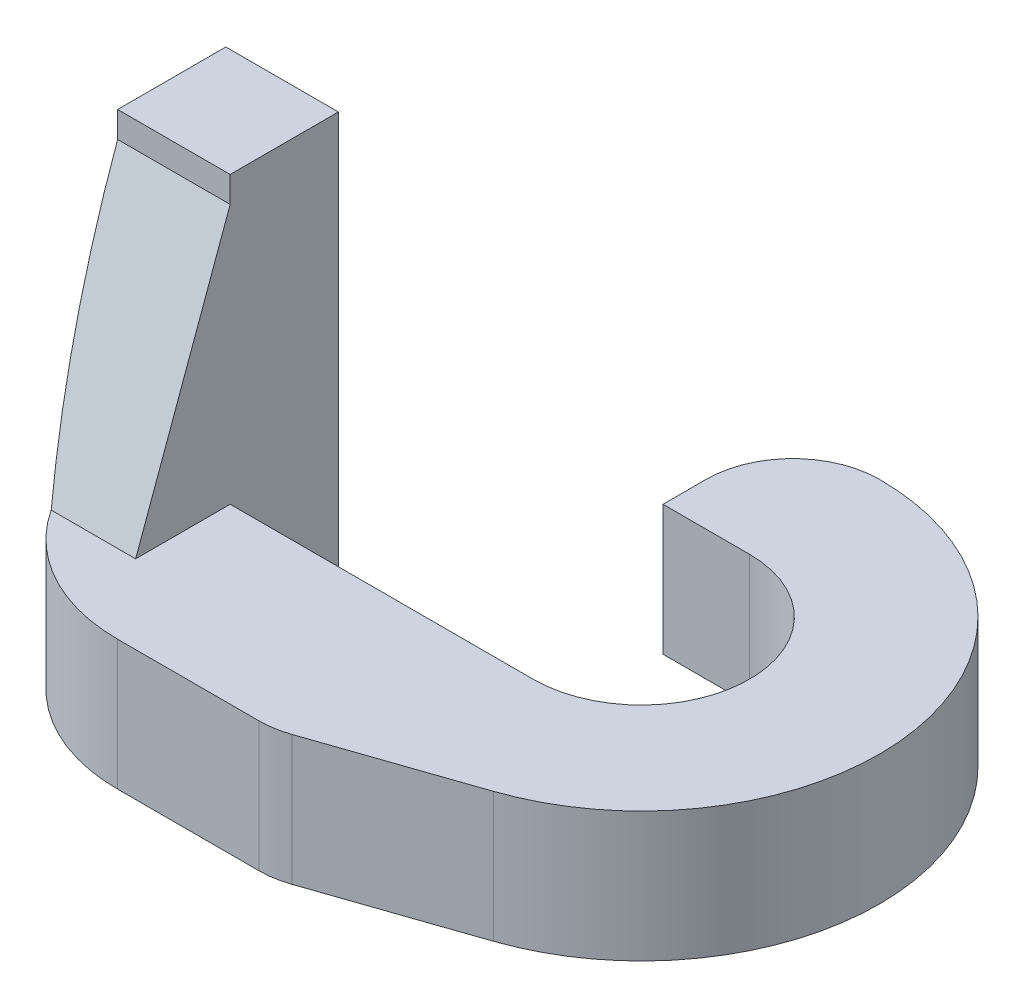
ISO-10303-21;
HEADER;
FILE_DESCRIPTION(('STEP AP214'),'2;1');
FILE_NAME('part.step','',(''),(''),'','','');
FILE_SCHEMA(('AUTOMOTIVE_DESIGN { 1 0 10303 214 1 1 1 1 }'));
ENDSEC;
DATA;
#1=APPLICATION_CONTEXT('core data for automotive mechanical design processes');
#2=APPLICATION_PROTOCOL_DEFINITION('international standard','automotive_design',2000,#1);
#3=PRODUCT_CONTEXT('',#1,'mechanical');
#4=PRODUCT('Part','Part','',(#3));
#5=PRODUCT_RELATED_PRODUCT_CATEGORY('part','',(#4));
#6=PRODUCT_DEFINITION_FORMATION('','',#4);
#7=PRODUCT_DEFINITION_CONTEXT('part definition',#1,'design');
#8=PRODUCT_DEFINITION('design','',#6,#7);
#9=PRODUCT_DEFINITION_SHAPE('','',#8);
#10=(LENGTH_UNIT() NAMED_UNIT(*) SI_UNIT(.MILLI.,.METRE.));
#11=(NAMED_UNIT(*) PLANE_ANGLE_UNIT() SI_UNIT($,.RADIAN.));
#12=(NAMED_UNIT(*) SI_UNIT($,.STERADIAN.) SOLID_ANGLE_UNIT());
#13=UNCERTAINTY_MEASURE_WITH_UNIT(LENGTH_MEASURE(1.E-05),#10,'distance_accuracy_value','');
#14=(GEOMETRIC_REPRESENTATION_CONTEXT(3) GLOBAL_UNCERTAINTY_ASSIGNED_CONTEXT((#13)) GLOBAL_UNIT_ASSIGNED_CONTEXT((#10,
#11,#12)) REPRESENTATION_CONTEXT('',''));
#15=CARTESIAN_POINT('',(0.,0.,0.));
#16=DIRECTION('',(0.,0.,1.));
#17=DIRECTION('',(1.,0.,0.));
#18=AXIS2_PLACEMENT_3D('',#15,#16,#17);
#19=CARTESIAN_POINT('',(9.6,0.,-3.5));
#20=DIRECTION('',(0.,1.,0.));
#21=DIRECTION('',(0.,0.,1.));
#22=AXIS2_PLACEMENT_3D('',#19,#20,#21);
#23=CYLINDRICAL_SURFACE('',#22,2.);
#24=CARTESIAN_POINT('',(9.6,0.,-3.5));
#25=DIRECTION('',(0.,-1.,0.));
#26=DIRECTION('',(0.,0.,1.));
#27=AXIS2_PLACEMENT_3D('',#24,#25,#26);
#28=CIRCLE('',#27,2.);
#29=CARTESIAN_POINT('',(7.6,0.,-3.5));
#30=VERTEX_POINT('',#29);
#31=CARTESIAN_POINT('',(9.6,0.,-5.5));
#32=VERTEX_POINT('',#31);
#33=EDGE_CURVE('E303',#30,#32,#28,.T.);
#34=ORIENTED_EDGE('',*,*,#33,.F.);
#35=DIRECTION('',(0.,-1.,0.));
#36=VECTOR('',#35,1.);
#37=CARTESIAN_POINT('',(7.6,0.,-3.5));
#38=LINE('',#37,#36);
#39=CARTESIAN_POINT('',(7.6,3.,-3.5));
#40=VERTEX_POINT('',#39);
#41=EDGE_CURVE('E9',#40,#30,#38,.T.);
#42=ORIENTED_EDGE('',*,*,#41,.F.);
#43=CARTESIAN_POINT('',(9.6,3.,-3.5));
#44=DIRECTION('',(0.,1.,0.));
#45=DIRECTION('',(0.,0.,-1.));
#46=AXIS2_PLACEMENT_3D('',#43,#44,#45);
#47=CIRCLE('',#46,2.);
#48=CARTESIAN_POINT('',(9.6,3.,-5.5));
#49=VERTEX_POINT('',#48);
#50=EDGE_CURVE('E221',#49,#40,#47,.T.);
#51=ORIENTED_EDGE('',*,*,#50,.F.);
#52=DIRECTION('',(0.,1.,0.));
#53=VECTOR('',#52,1.);
#54=CARTESIAN_POINT('',(9.6,0.,-5.5));
#55=LINE('',#54,#53);
#56=EDGE_CURVE('E174',#32,#49,#55,.T.);
#57=ORIENTED_EDGE('',*,*,#56,.F.);
#58=EDGE_LOOP('',(#34,#42,#51,#57));
#59=FACE_BOUND('',#58,.T.);
#60=ADVANCED_FACE('F14',(#59),#23,.T.);
#61=CARTESIAN_POINT('',(7.26666666666666,0.,4.5));
#62=DIRECTION('',(0.,1.,0.));
#63=DIRECTION('',(0.,0.,1.));
#64=AXIS2_PLACEMENT_3D('',#61,#62,#63);
#65=CYLINDRICAL_SURFACE('',#64,2.);
#66=CARTESIAN_POINT('',(7.26666666666666,0.,4.5));
#67=DIRECTION('',(0.,-1.,0.));
#68=DIRECTION('',(0.,0.,1.));
#69=AXIS2_PLACEMENT_3D('',#66,#67,#68);
#70=CIRCLE('',#69,2.);
#71=CARTESIAN_POINT('',(7.91531531531532,0.,6.39189189189189));
#72=VERTEX_POINT('',#71);
#73=CARTESIAN_POINT('',(7.26666666666666,0.,6.5));
#74=VERTEX_POINT('',#73);
#75=EDGE_CURVE('E178',#72,#74,#70,.T.);
#76=ORIENTED_EDGE('',*,*,#75,.F.);
#77=DIRECTION('',(0.,-1.,0.));
#78=VECTOR('',#77,1.);
#79=CARTESIAN_POINT('',(7.91531531531532,0.,6.39189189189189));
#80=LINE('',#79,#78);
#81=CARTESIAN_POINT('',(7.91531531531532,3.,6.39189189189189));
#82=VERTEX_POINT('',#81);
#83=EDGE_CURVE('E163',#82,#72,#80,.T.);
#84=ORIENTED_EDGE('',*,*,#83,.F.);
#85=CARTESIAN_POINT('',(7.26666666666666,3.,4.5));
#86=DIRECTION('',(0.,1.,0.));
#87=DIRECTION('',(0.,0.,-1.));
#88=AXIS2_PLACEMENT_3D('',#85,#86,#87);
#89=CIRCLE('',#88,2.);
#90=CARTESIAN_POINT('',(7.26666666666666,3.,6.5));
#91=VERTEX_POINT('',#90);
#92=EDGE_CURVE('E207',#91,#82,#89,.T.);
#93=ORIENTED_EDGE('',*,*,#92,.F.);
#94=DIRECTION('',(0.,1.,0.));
#95=VECTOR('',#94,1.);
#96=CARTESIAN_POINT('',(7.26666666666666,0.,6.5));
#97=LINE('',#96,#95);
#98=EDGE_CURVE('E180',#74,#91,#97,.T.);
#99=ORIENTED_EDGE('',*,*,#98,.F.);
#100=EDGE_LOOP('',(#76,#84,#93,#99));
#101=FACE_BOUND('',#100,.T.);
#102=ADVANCED_FACE('F179',(#101),#65,.T.);
#103=CARTESIAN_POINT('',(7.6,0.,0.));
#104=DIRECTION('',(1.,0.,0.));
#105=DIRECTION('',(0.,0.,-1.));
#106=AXIS2_PLACEMENT_3D('',#103,#104,#105);
#107=PLANE('',#106);
#108=DIRECTION('',(0.,0.,-1.));
#109=VECTOR('',#108,1.);
#110=CARTESIAN_POINT('',(7.6,3.,0.));
#111=LINE('',#110,#109);
#112=CARTESIAN_POINT('',(7.6,3.,-2.5));
#113=VERTEX_POINT('',#112);
#114=EDGE_CURVE('E216',#113,#40,#111,.T.);
#115=ORIENTED_EDGE('',*,*,#114,.T.);
#116=ORIENTED_EDGE('',*,*,#41,.T.);
#117=DIRECTION('',(0.,0.,-1.));
#118=VECTOR('',#117,1.);
#119=CARTESIAN_POINT('',(7.6,0.,0.));
#120=LINE('',#119,#118);
#121=CARTESIAN_POINT('',(7.6,0.,-2.5));
#122=VERTEX_POINT('',#121);
#123=EDGE_CURVE('E286',#122,#30,#120,.T.);
#124=ORIENTED_EDGE('',*,*,#123,.F.);
#125=DIRECTION('',(0.,1.,0.));
#126=VECTOR('',#125,1.);
#127=CARTESIAN_POINT('',(7.6,0.,-2.5));
#128=LINE('',#127,#126);
#129=EDGE_CURVE('E25',#122,#113,#128,.T.);
#130=ORIENTED_EDGE('',*,*,#129,.T.);
#131=EDGE_LOOP('',(#115,#116,#124,#130));
#132=FACE_BOUND('',#131,.T.);
#133=ADVANCED_FACE('F527',(#132),#107,.F.);
#134=CARTESIAN_POINT('',(0.,0.,-2.5));
#135=DIRECTION('',(0.,0.,-1.));
#136=DIRECTION('',(-1.,0.,0.));
#137=AXIS2_PLACEMENT_3D('',#134,#135,#136);
#138=PLANE('',#137);
#139=DIRECTION('',(-1.,0.,0.));
#140=VECTOR('',#139,1.);
#141=CARTESIAN_POINT('',(0.,3.,-2.5));
#142=LINE('',#141,#140);
#143=CARTESIAN_POINT('',(9.6,3.,-2.5));
#144=VERTEX_POINT('',#143);
#145=EDGE_CURVE('E220',#144,#113,#142,.T.);
#146=ORIENTED_EDGE('',*,*,#145,.T.);
#147=ORIENTED_EDGE('',*,*,#129,.F.);
#148=DIRECTION('',(-1.,0.,0.));
#149=VECTOR('',#148,1.);
#150=CARTESIAN_POINT('',(0.,0.,-2.5));
#151=LINE('',#150,#149);
#152=CARTESIAN_POINT('',(9.6,0.,-2.5));
#153=VERTEX_POINT('',#152);
#154=EDGE_CURVE('E281',#153,#122,#151,.T.);
#155=ORIENTED_EDGE('',*,*,#154,.F.);
#156=DIRECTION('',(0.,1.,0.));
#157=VECTOR('',#156,1.);
#158=CARTESIAN_POINT('',(9.6,0.,-2.5));
#159=LINE('',#158,#157);
#160=EDGE_CURVE('E108',#153,#144,#159,.T.);
#161=ORIENTED_EDGE('',*,*,#160,.T.);
#162=EDGE_LOOP('',(#146,#147,#155,#161));
#163=FACE_BOUND('',#162,.T.);
#164=ADVANCED_FACE('F531',(#163),#138,.F.);
#165=CARTESIAN_POINT('',(9.6,0.,0.));
#166=DIRECTION('',(0.,1.,0.));
#167=DIRECTION('',(0.,0.,1.));
#168=AXIS2_PLACEMENT_3D('',#165,#166,#167);
#169=CYLINDRICAL_SURFACE('',#168,2.5);
#170=CARTESIAN_POINT('',(9.6,3.,0.));
#171=DIRECTION('',(0.,1.,0.));
#172=DIRECTION('',(0.,0.,1.));
#173=AXIS2_PLACEMENT_3D('',#170,#171,#172);
#174=CIRCLE('',#173,2.5);
#175=CARTESIAN_POINT('',(9.6,3.,2.5));
#176=VERTEX_POINT('',#175);
#177=EDGE_CURVE('E291',#176,#144,#174,.T.);
#178=ORIENTED_EDGE('',*,*,#177,.T.);
#179=ORIENTED_EDGE('',*,*,#160,.F.);
#180=CARTESIAN_POINT('',(9.6,0.,0.));
#181=DIRECTION('',(0.,1.,0.));
#182=DIRECTION('',(0.,0.,1.));
#183=AXIS2_PLACEMENT_3D('',#180,#181,#182);
#184=CIRCLE('',#183,2.5);
#185=CARTESIAN_POINT('',(9.6,0.,2.5));
#186=VERTEX_POINT('',#185);
#187=EDGE_CURVE('E277',#186,#153,#184,.T.);
#188=ORIENTED_EDGE('',*,*,#187,.F.);
#189=DIRECTION('',(0.,1.,0.));
#190=VECTOR('',#189,1.);
#191=CARTESIAN_POINT('',(9.6,0.,2.5));
#192=LINE('',#191,#190);
#193=EDGE_CURVE('E270',#186,#176,#192,.T.);
#194=ORIENTED_EDGE('',*,*,#193,.T.);
#195=EDGE_LOOP('',(#178,#179,#188,#194));
#196=FACE_BOUND('',#195,.T.);
#197=ADVANCED_FACE('F567',(#196),#169,.F.);
#198=CARTESIAN_POINT('',(2.79357195032871,0.,8.14791818845873));
#199=DIRECTION('',(0.324324324324324,0.,0.945945945945946));
#200=DIRECTION('',(0.,-1.,0.));
#201=AXIS2_PLACEMENT_3D('',#198,#199,#200);
#202=PLANE('',#201);
#203=DIRECTION('',(0.945945945945946,0.,-0.324324324324324));
#204=VECTOR('',#203,1.);
#205=CARTESIAN_POINT('',(2.79357195032871,3.,8.14791818845873));
#206=LINE('',#205,#204);
#207=CARTESIAN_POINT('',(11.3837837837838,3.,5.2027027027027));
#208=VERTEX_POINT('',#207);
#209=EDGE_CURVE('E169',#82,#208,#206,.T.);
#210=ORIENTED_EDGE('',*,*,#209,.F.);
#211=ORIENTED_EDGE('',*,*,#83,.T.);
#212=DIRECTION('',(0.945945945945946,0.,-0.324324324324324));
#213=VECTOR('',#212,1.);
#214=CARTESIAN_POINT('',(2.79357195032871,0.,8.14791818845873));
#215=LINE('',#214,#213);
#216=CARTESIAN_POINT('',(11.3837837837838,0.,5.2027027027027));
#217=VERTEX_POINT('',#216);
#218=EDGE_CURVE('E167',#72,#217,#215,.T.);
#219=ORIENTED_EDGE('',*,*,#218,.T.);
#220=DIRECTION('',(0.,1.,0.));
#221=VECTOR('',#220,1.);
#222=CARTESIAN_POINT('',(11.3837837837838,0.,5.2027027027027));
#223=LINE('',#222,#221);
#224=EDGE_CURVE('E234',#217,#208,#223,.T.);
#225=ORIENTED_EDGE('',*,*,#224,.T.);
#226=EDGE_LOOP('',(#210,#211,#219,#225));
#227=FACE_BOUND('',#226,.T.);
#228=ADVANCED_FACE('F165',(#227),#202,.T.);
#229=CARTESIAN_POINT('',(9.6,0.,0.));
#230=DIRECTION('',(0.,1.,0.));
#231=DIRECTION('',(0.,0.,1.));
#232=AXIS2_PLACEMENT_3D('',#229,#230,#231);
#233=CYLINDRICAL_SURFACE('',#232,5.5);
#234=CARTESIAN_POINT('',(9.6,3.,0.));
#235=DIRECTION('',(0.,1.,0.));
#236=DIRECTION('',(0.,0.,1.));
#237=AXIS2_PLACEMENT_3D('',#234,#235,#236);
#238=CIRCLE('',#237,5.5);
#239=EDGE_CURVE('E228',#208,#49,#238,.T.);
#240=ORIENTED_EDGE('',*,*,#239,.F.);
#241=ORIENTED_EDGE('',*,*,#224,.F.);
#242=CARTESIAN_POINT('',(9.6,0.,0.));
#243=DIRECTION('',(0.,1.,0.));
#244=DIRECTION('',(0.,0.,1.));
#245=AXIS2_PLACEMENT_3D('',#242,#243,#244);
#246=CIRCLE('',#245,5.5);
#247=EDGE_CURVE('E191',#217,#32,#246,.T.);
#248=ORIENTED_EDGE('',*,*,#247,.T.);
#249=ORIENTED_EDGE('',*,*,#56,.T.);
#250=EDGE_LOOP('',(#240,#241,#248,#249));
#251=FACE_BOUND('',#250,.T.);
#252=ADVANCED_FACE('F356',(#251),#233,.T.);
#253=CARTESIAN_POINT('',(4.,0.,2.5));
#254=DIRECTION('',(0.,1.,0.));
#255=DIRECTION('',(0.,0.,1.));
#256=AXIS2_PLACEMENT_3D('',#253,#254,#255);
#257=CYLINDRICAL_SURFACE('',#256,4.);
#258=CARTESIAN_POINT('',(0.,9.,2.5));
#259=CARTESIAN_POINT('',(0.,6.85439242775356,3.28093729071387));
#260=CARTESIAN_POINT('',(0.222386019238584,4.79762064602606,4.02954099794134));
#261=CARTESIAN_POINT('',(0.648742912211093,3.,4.68382140559722));
#262=(BOUNDED_CURVE() B_SPLINE_CURVE(3,(#258,#259,#260,#261),.UNSPECIFIED.,.F.,
.F.) B_SPLINE_CURVE_WITH_KNOTS((4,4),(1.5707963267949,2.14832530863416),
.UNSPECIFIED.) CURVE() GEOMETRIC_REPRESENTATION_ITEM() RATIONAL_B_SPLINE_CURVE((1.,
0.972397627081488,0.972397627081488,1.)) REPRESENTATION_ITEM(''));
#263=CARTESIAN_POINT('',(0.,9.,2.5));
#264=VERTEX_POINT('',#263);
#265=CARTESIAN_POINT('',(0.648742912211093,3.,4.68382140559722));
#266=VERTEX_POINT('',#265);
#267=EDGE_CURVE('E40',#264,#266,#262,.T.);
#268=ORIENTED_EDGE('',*,*,#267,.F.);
#269=DIRECTION('',(0.,1.,0.));
#270=VECTOR('',#269,1.);
#271=CARTESIAN_POINT('',(0.,3.,2.5));
#272=LINE('',#271,#270);
#273=CARTESIAN_POINT('',(0.,0.,2.5));
#274=VERTEX_POINT('',#273);
#275=EDGE_CURVE('E298',#274,#264,#272,.T.);
#276=ORIENTED_EDGE('',*,*,#275,.F.);
#277=CARTESIAN_POINT('',(4.,0.,2.5));
#278=DIRECTION('',(0.,-1.,0.));
#279=DIRECTION('',(0.,0.,1.));
#280=AXIS2_PLACEMENT_3D('',#277,#278,#279);
#281=CIRCLE('',#280,4.);
#282=CARTESIAN_POINT('',(4.,0.,6.5));
#283=VERTEX_POINT('',#282);
#284=EDGE_CURVE('E222',#283,#274,#281,.T.);
#285=ORIENTED_EDGE('',*,*,#284,.F.);
#286=DIRECTION('',(0.,-1.,0.));
#287=VECTOR('',#286,1.);
#288=CARTESIAN_POINT('',(4.,0.,6.5));
#289=LINE('',#288,#287);
#290=CARTESIAN_POINT('',(4.,3.,6.5));
#291=VERTEX_POINT('',#290);
#292=EDGE_CURVE('E229',#291,#283,#289,.T.);
#293=ORIENTED_EDGE('',*,*,#292,.F.);
#294=CARTESIAN_POINT('',(4.,3.,2.5));
#295=DIRECTION('',(0.,1.,0.));
#296=DIRECTION('',(0.,0.,-1.));
#297=AXIS2_PLACEMENT_3D('',#294,#295,#296);
#298=CIRCLE('',#297,4.);
#299=EDGE_CURVE('E18',#266,#291,#298,.T.);
#300=ORIENTED_EDGE('',*,*,#299,.F.);
#301=EDGE_LOOP('',(#268,#276,#285,#293,#300));
#302=FACE_BOUND('',#301,.T.);
#303=ADVANCED_FACE('F522',(#302),#257,.T.);
#304=CARTESIAN_POINT('',(0.,3.,4.68382140559722));
#305=DIRECTION('',(0.,0.342020143325672,0.939692620785907));
#306=DIRECTION('',(1.,0.,0.));
#307=AXIS2_PLACEMENT_3D('',#304,#305,#306);
#308=PLANE('',#307);
#309=DIRECTION('',(1.,0.,0.));
#310=VECTOR('',#309,1.);
#311=CARTESIAN_POINT('',(2.6,9.,2.5));
#312=LINE('',#311,#310);
#313=CARTESIAN_POINT('',(2.6,9.,2.5));
#314=VERTEX_POINT('',#313);
#315=EDGE_CURVE('E254',#264,#314,#312,.T.);
#316=ORIENTED_EDGE('',*,*,#315,.F.);
#317=ORIENTED_EDGE('',*,*,#267,.T.);
#318=DIRECTION('',(-1.,0.,0.));
#319=VECTOR('',#318,1.);
#320=CARTESIAN_POINT('',(0.,3.,4.68382140559722));
#321=LINE('',#320,#319);
#322=CARTESIAN_POINT('',(2.6,3.,4.68382140559722));
#323=VERTEX_POINT('',#322);
#324=EDGE_CURVE('E287',#323,#266,#321,.T.);
#325=ORIENTED_EDGE('',*,*,#324,.F.);
#326=DIRECTION('',(0.,-0.939692620785907,0.342020143325672));
#327=VECTOR('',#326,1.);
#328=CARTESIAN_POINT('',(2.6,1.05280000596461,5.39254424358944));
#329=LINE('',#328,#327);
#330=EDGE_CURVE('E210',#314,#323,#329,.T.);
#331=ORIENTED_EDGE('',*,*,#330,.F.);
#332=EDGE_LOOP('',(#316,#317,#325,#331));
#333=FACE_BOUND('',#332,.T.);
#334=ADVANCED_FACE('F558',(#333),#308,.T.);
#335=CARTESIAN_POINT('',(0.,0.,6.5));
#336=DIRECTION('',(0.,0.,1.));
#337=DIRECTION('',(1.,0.,0.));
#338=AXIS2_PLACEMENT_3D('',#335,#336,#337);
#339=PLANE('',#338);
#340=DIRECTION('',(1.,0.,0.));
#341=VECTOR('',#340,1.);
#342=CARTESIAN_POINT('',(0.,0.,6.5));
#343=LINE('',#342,#341);
#344=EDGE_CURVE('E185',#283,#74,#343,.T.);
#345=ORIENTED_EDGE('',*,*,#344,.T.);
#346=ORIENTED_EDGE('',*,*,#98,.T.);
#347=DIRECTION('',(-1.,0.,0.));
#348=VECTOR('',#347,1.);
#349=CARTESIAN_POINT('',(0.,3.,6.5));
#350=LINE('',#349,#348);
#351=EDGE_CURVE('E209',#91,#291,#350,.T.);
#352=ORIENTED_EDGE('',*,*,#351,.T.);
#353=ORIENTED_EDGE('',*,*,#292,.T.);
#354=EDGE_LOOP('',(#345,#346,#352,#353));
#355=FACE_BOUND('',#354,.T.);
#356=ADVANCED_FACE('F553',(#355),#339,.T.);
#357=CARTESIAN_POINT('',(0.,3.,6.5));
#358=DIRECTION('',(0.,-1.,0.));
#359=DIRECTION('',(0.,0.,-1.));
#360=AXIS2_PLACEMENT_3D('',#357,#358,#359);
#361=PLANE('',#360);
#362=ORIENTED_EDGE('',*,*,#351,.F.);
#363=ORIENTED_EDGE('',*,*,#92,.T.);
#364=ORIENTED_EDGE('',*,*,#209,.T.);
#365=ORIENTED_EDGE('',*,*,#239,.T.);
#366=ORIENTED_EDGE('',*,*,#50,.T.);
#367=ORIENTED_EDGE('',*,*,#114,.F.);
#368=ORIENTED_EDGE('',*,*,#145,.F.);
#369=ORIENTED_EDGE('',*,*,#177,.F.);
#370=DIRECTION('',(-1.,0.,0.));
#371=VECTOR('',#370,1.);
#372=CARTESIAN_POINT('',(0.,3.,2.5));
#373=LINE('',#372,#371);
#374=CARTESIAN_POINT('',(2.6,3.,2.5));
#375=VERTEX_POINT('',#374);
#376=EDGE_CURVE('E267',#176,#375,#373,.T.);
#377=ORIENTED_EDGE('',*,*,#376,.T.);
#378=DIRECTION('',(0.,0.,1.));
#379=VECTOR('',#378,1.);
#380=CARTESIAN_POINT('',(2.6,3.,2.5));
#381=LINE('',#380,#379);
#382=EDGE_CURVE('E214',#375,#323,#381,.T.);
#383=ORIENTED_EDGE('',*,*,#382,.T.);
#384=ORIENTED_EDGE('',*,*,#324,.T.);
#385=ORIENTED_EDGE('',*,*,#299,.T.);
#386=EDGE_LOOP('',(#362,#363,#364,#365,#366,#367,#368,#369,#377,#383,#384,#385));
#387=FACE_BOUND('',#386,.T.);
#388=ADVANCED_FACE('F557',(#387),#361,.F.);
#389=CARTESIAN_POINT('',(0.,0.,2.5));
#390=DIRECTION('',(0.,0.,1.));
#391=DIRECTION('',(1.,0.,0.));
#392=AXIS2_PLACEMENT_3D('',#389,#390,#391);
#393=PLANE('',#392);
#394=DIRECTION('',(1.,0.,0.));
#395=VECTOR('',#394,1.);
#396=CARTESIAN_POINT('',(0.,0.,2.5));
#397=LINE('',#396,#395);
#398=CARTESIAN_POINT('',(2.6,0.,2.5));
#399=VERTEX_POINT('',#398);
#400=EDGE_CURVE('E282',#399,#186,#397,.T.);
#401=ORIENTED_EDGE('',*,*,#400,.F.);
#402=DIRECTION('',(0.,1.,0.));
#403=VECTOR('',#402,1.);
#404=CARTESIAN_POINT('',(2.6,0.,2.5));
#405=LINE('',#404,#403);
#406=EDGE_CURVE('E242',#399,#375,#405,.T.);
#407=ORIENTED_EDGE('',*,*,#406,.T.);
#408=ORIENTED_EDGE('',*,*,#376,.F.);
#409=ORIENTED_EDGE('',*,*,#193,.F.);
#410=EDGE_LOOP('',(#401,#407,#408,#409));
#411=FACE_BOUND('',#410,.T.);
#412=ADVANCED_FACE('F504',(#411),#393,.F.);
#413=CARTESIAN_POINT('',(0.,0.,0.));
#414=DIRECTION('',(0.,0.,-1.));
#415=DIRECTION('',(0.,-1.,0.));
#416=AXIS2_PLACEMENT_3D('',#413,#414,#415);
#417=PLANE('',#416);
#418=DIRECTION('',(0.,-1.,0.));
#419=VECTOR('',#418,1.);
#420=CARTESIAN_POINT('',(0.,0.,0.));
#421=LINE('',#420,#419);
#422=CARTESIAN_POINT('',(0.,9.6,0.));
#423=VERTEX_POINT('',#422);
#424=CARTESIAN_POINT('',(0.,0.,0.));
#425=VERTEX_POINT('',#424);
#426=EDGE_CURVE('E193',#423,#425,#421,.T.);
#427=ORIENTED_EDGE('',*,*,#426,.F.);
#428=DIRECTION('',(-1.,0.,0.));
#429=VECTOR('',#428,1.);
#430=CARTESIAN_POINT('',(0.,9.6,0.));
#431=LINE('',#430,#429);
#432=CARTESIAN_POINT('',(2.6,9.6,0.));
#433=VERTEX_POINT('',#432);
#434=EDGE_CURVE('E264',#433,#423,#431,.T.);
#435=ORIENTED_EDGE('',*,*,#434,.F.);
#436=DIRECTION('',(0.,1.,0.));
#437=VECTOR('',#436,1.);
#438=CARTESIAN_POINT('',(2.6,0.,0.));
#439=LINE('',#438,#437);
#440=CARTESIAN_POINT('',(2.6,0.,0.));
#441=VERTEX_POINT('',#440);
#442=EDGE_CURVE('E205',#441,#433,#439,.T.);
#443=ORIENTED_EDGE('',*,*,#442,.F.);
#444=DIRECTION('',(1.,0.,0.));
#445=VECTOR('',#444,1.);
#446=CARTESIAN_POINT('',(0.,0.,0.));
#447=LINE('',#446,#445);
#448=EDGE_CURVE('E225',#425,#441,#447,.T.);
#449=ORIENTED_EDGE('',*,*,#448,.F.);
#450=EDGE_LOOP('',(#427,#435,#443,#449));
#451=FACE_BOUND('',#450,.T.);
#452=ADVANCED_FACE('F500',(#451),#417,.T.);
#453=CARTESIAN_POINT('',(0.,9.6,2.5));
#454=DIRECTION('',(0.,-1.,0.));
#455=DIRECTION('',(0.,0.,-1.));
#456=AXIS2_PLACEMENT_3D('',#453,#454,#455);
#457=PLANE('',#456);
#458=ORIENTED_EDGE('',*,*,#434,.T.);
#459=DIRECTION('',(0.,0.,-1.));
#460=VECTOR('',#459,1.);
#461=CARTESIAN_POINT('',(0.,9.6,2.5));
#462=LINE('',#461,#460);
#463=CARTESIAN_POINT('',(0.,9.6,2.5));
#464=VERTEX_POINT('',#463);
#465=EDGE_CURVE('E201',#464,#423,#462,.T.);
#466=ORIENTED_EDGE('',*,*,#465,.F.);
#467=DIRECTION('',(-1.,0.,0.));
#468=VECTOR('',#467,1.);
#469=CARTESIAN_POINT('',(0.,9.6,2.5));
#470=LINE('',#469,#468);
#471=CARTESIAN_POINT('',(2.6,9.6,2.5));
#472=VERTEX_POINT('',#471);
#473=EDGE_CURVE('E253',#472,#464,#470,.T.);
#474=ORIENTED_EDGE('',*,*,#473,.F.);
#475=DIRECTION('',(0.,0.,-1.));
#476=VECTOR('',#475,1.);
#477=CARTESIAN_POINT('',(2.6,9.6,2.5));
#478=LINE('',#477,#476);
#479=EDGE_CURVE('E215',#472,#433,#478,.T.);
#480=ORIENTED_EDGE('',*,*,#479,.T.);
#481=EDGE_LOOP('',(#458,#466,#474,#480));
#482=FACE_BOUND('',#481,.T.);
#483=ADVANCED_FACE('F16',(#482),#457,.F.);
#484=CARTESIAN_POINT('',(2.6,0.,2.5));
#485=DIRECTION('',(-1.,0.,0.));
#486=DIRECTION('',(0.,1.,0.));
#487=AXIS2_PLACEMENT_3D('',#484,#485,#486);
#488=PLANE('',#487);
#489=ORIENTED_EDGE('',*,*,#442,.T.);
#490=ORIENTED_EDGE('',*,*,#479,.F.);
#491=DIRECTION('',(0.,1.,0.));
#492=VECTOR('',#491,1.);
#493=CARTESIAN_POINT('',(2.6,0.,2.5));
#494=LINE('',#493,#492);
#495=EDGE_CURVE('E247',#314,#472,#494,.T.);
#496=ORIENTED_EDGE('',*,*,#495,.F.);
#497=ORIENTED_EDGE('',*,*,#330,.T.);
#498=ORIENTED_EDGE('',*,*,#382,.F.);
#499=ORIENTED_EDGE('',*,*,#406,.F.);
#500=DIRECTION('',(0.,0.,-1.));
#501=VECTOR('',#500,1.);
#502=CARTESIAN_POINT('',(2.6,0.,2.5));
#503=LINE('',#502,#501);
#504=EDGE_CURVE('E292',#399,#441,#503,.T.);
#505=ORIENTED_EDGE('',*,*,#504,.T.);
#506=EDGE_LOOP('',(#489,#490,#496,#497,#498,#499,#505));
#507=FACE_BOUND('',#506,.T.);
#508=ADVANCED_FACE('F514',(#507),#488,.F.);
#509=CARTESIAN_POINT('',(0.,0.,2.5));
#510=DIRECTION('',(0.,1.,0.));
#511=DIRECTION('',(1.,0.,0.));
#512=AXIS2_PLACEMENT_3D('',#509,#510,#511);
#513=PLANE('',#512);
#514=ORIENTED_EDGE('',*,*,#218,.F.);
#515=ORIENTED_EDGE('',*,*,#75,.T.);
#516=ORIENTED_EDGE('',*,*,#344,.F.);
#517=ORIENTED_EDGE('',*,*,#284,.T.);
#518=DIRECTION('',(0.,0.,-1.));
#519=VECTOR('',#518,1.);
#520=CARTESIAN_POINT('',(0.,0.,2.5));
#521=LINE('',#520,#519);
#522=EDGE_CURVE('E263',#274,#425,#521,.T.);
#523=ORIENTED_EDGE('',*,*,#522,.T.);
#524=ORIENTED_EDGE('',*,*,#448,.T.);
#525=ORIENTED_EDGE('',*,*,#504,.F.);
#526=ORIENTED_EDGE('',*,*,#400,.T.);
#527=ORIENTED_EDGE('',*,*,#187,.T.);
#528=ORIENTED_EDGE('',*,*,#154,.T.);
#529=ORIENTED_EDGE('',*,*,#123,.T.);
#530=ORIENTED_EDGE('',*,*,#33,.T.);
#531=ORIENTED_EDGE('',*,*,#247,.F.);
#532=EDGE_LOOP('',(#514,#515,#516,#517,#523,#524,#525,#526,#527,#528,#529,#530,#531));
#533=FACE_BOUND('',#532,.T.);
#534=ADVANCED_FACE('F188',(#533),#513,.F.);
#535=CARTESIAN_POINT('',(0.,0.,2.5));
#536=DIRECTION('',(1.,0.,0.));
#537=DIRECTION('',(0.,1.,0.));
#538=AXIS2_PLACEMENT_3D('',#535,#536,#537);
#539=PLANE('',#538);
#540=ORIENTED_EDGE('',*,*,#522,.F.);
#541=ORIENTED_EDGE('',*,*,#275,.T.);
#542=DIRECTION('',(0.,-1.,0.));
#543=VECTOR('',#542,1.);
#544=CARTESIAN_POINT('',(0.,0.,2.5));
#545=LINE('',#544,#543);
#546=EDGE_CURVE('E259',#464,#264,#545,.T.);
#547=ORIENTED_EDGE('',*,*,#546,.F.);
#548=ORIENTED_EDGE('',*,*,#465,.T.);
#549=ORIENTED_EDGE('',*,*,#426,.T.);
#550=EDGE_LOOP('',(#540,#541,#547,#548,#549));
#551=FACE_BOUND('',#550,.T.);
#552=ADVANCED_FACE('F513',(#551),#539,.F.);
#553=CARTESIAN_POINT('',(0.,0.,2.5));
#554=DIRECTION('',(0.,0.,-1.));
#555=DIRECTION('',(0.,-1.,0.));
#556=AXIS2_PLACEMENT_3D('',#553,#554,#555);
#557=PLANE('',#556);
#558=ORIENTED_EDGE('',*,*,#546,.T.);
#559=ORIENTED_EDGE('',*,*,#315,.T.);
#560=ORIENTED_EDGE('',*,*,#495,.T.);
#561=ORIENTED_EDGE('',*,*,#473,.T.);
#562=EDGE_LOOP('',(#558,#559,#560,#561));
#563=FACE_BOUND('',#562,.T.);
#564=ADVANCED_FACE('F547',(#563),#557,.F.);
#565=CLOSED_SHELL('',(#60,#102,#133,#164,#197,#228,#252,#303,#334,#356,#388,#412,#452,#483,#508,
#534,#552,#564));
#566=MANIFOLD_SOLID_BREP('B1',#565);
#567=ADVANCED_BREP_SHAPE_REPRESENTATION('',(#18,#566),#14);
#568=SHAPE_DEFINITION_REPRESENTATION(#9,#567);
ENDSEC;
END-ISO-10303-21;
